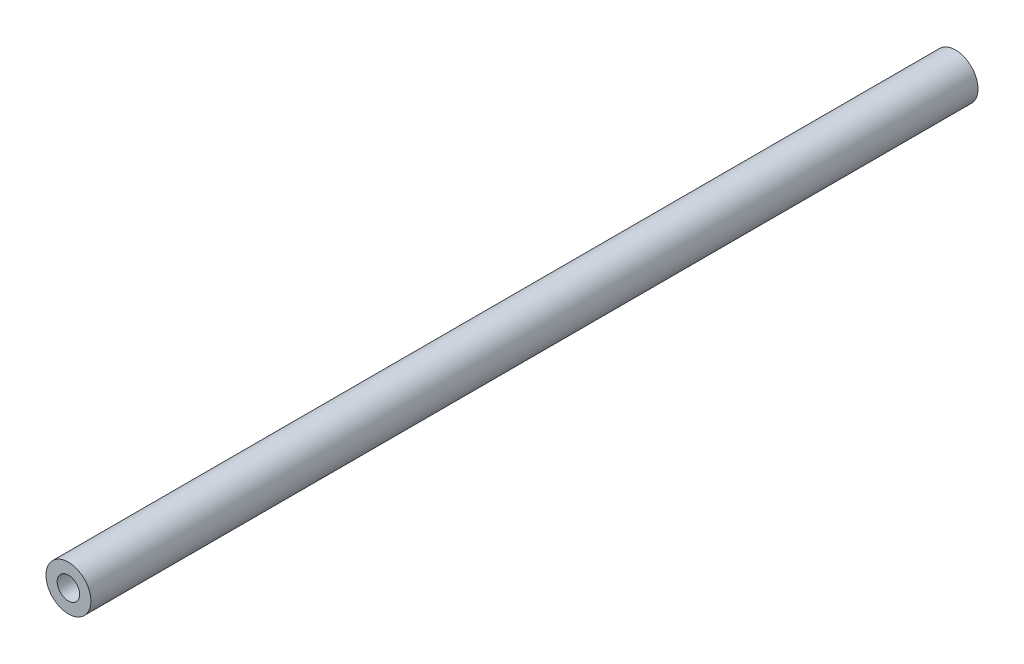
ISO-10303-21;
HEADER;
FILE_DESCRIPTION(('STEP AP214'),'2;1');
FILE_NAME('part.step','',(''),(''),'','','');
FILE_SCHEMA(('AUTOMOTIVE_DESIGN { 1 0 10303 214 1 1 1 1 }'));
ENDSEC;
DATA;
#1=APPLICATION_CONTEXT('core data for automotive mechanical design processes');
#2=APPLICATION_PROTOCOL_DEFINITION('international standard','automotive_design',2000,#1);
#3=PRODUCT_CONTEXT('',#1,'mechanical');
#4=PRODUCT('Part','Part','',(#3));
#5=PRODUCT_RELATED_PRODUCT_CATEGORY('part','',(#4));
#6=PRODUCT_DEFINITION_FORMATION('','',#4);
#7=PRODUCT_DEFINITION_CONTEXT('part definition',#1,'design');
#8=PRODUCT_DEFINITION('design','',#6,#7);
#9=PRODUCT_DEFINITION_SHAPE('','',#8);
#10=(LENGTH_UNIT() NAMED_UNIT(*) SI_UNIT(.MILLI.,.METRE.));
#11=(NAMED_UNIT(*) PLANE_ANGLE_UNIT() SI_UNIT($,.RADIAN.));
#12=(NAMED_UNIT(*) SI_UNIT($,.STERADIAN.) SOLID_ANGLE_UNIT());
#13=UNCERTAINTY_MEASURE_WITH_UNIT(LENGTH_MEASURE(1.E-05),#10,'distance_accuracy_value','');
#14=(GEOMETRIC_REPRESENTATION_CONTEXT(3) GLOBAL_UNCERTAINTY_ASSIGNED_CONTEXT((#13)) GLOBAL_UNIT_ASSIGNED_CONTEXT((#10,
#11,#12)) REPRESENTATION_CONTEXT('',''));
#15=CARTESIAN_POINT('',(0.,0.,0.));
#16=DIRECTION('',(0.,0.,1.));
#17=DIRECTION('',(1.,0.,0.));
#18=AXIS2_PLACEMENT_3D('',#15,#16,#17);
#19=CARTESIAN_POINT('',(0.,0.,79.));
#20=DIRECTION('',(0.,0.,1.));
#21=DIRECTION('',(1.,0.,0.));
#22=AXIS2_PLACEMENT_3D('',#19,#20,#21);
#23=PLANE('',#22);
#24=CARTESIAN_POINT('',(0.,0.,79.));
#25=DIRECTION('',(0.,0.,1.));
#26=DIRECTION('',(1.,0.,0.));
#27=AXIS2_PLACEMENT_3D('',#24,#25,#26);
#28=CIRCLE('',#27,2.);
#29=CARTESIAN_POINT('',(2.,0.,79.));
#30=VERTEX_POINT('',#29);
#31=EDGE_CURVE('E10',#30,#30,#28,.T.);
#32=ORIENTED_EDGE('',*,*,#31,.T.);
#33=EDGE_LOOP('',(#32));
#34=FACE_BOUND('',#33,.T.);
#35=CARTESIAN_POINT('',(0.,0.,79.));
#36=DIRECTION('',(0.,0.,1.));
#37=DIRECTION('',(1.,0.,0.));
#38=AXIS2_PLACEMENT_3D('',#35,#36,#37);
#39=CIRCLE('',#38,1.);
#40=CARTESIAN_POINT('',(1.,0.,79.));
#41=VERTEX_POINT('',#40);
#42=EDGE_CURVE('E42',#41,#41,#39,.T.);
#43=ORIENTED_EDGE('',*,*,#42,.F.);
#44=EDGE_LOOP('',(#43));
#45=FACE_BOUND('',#44,.T.);
#46=ADVANCED_FACE('F31',(#34,#45),#23,.T.);
#47=CARTESIAN_POINT('',(0.,0.,0.));
#48=DIRECTION('',(0.,0.,1.));
#49=DIRECTION('',(1.,0.,0.));
#50=AXIS2_PLACEMENT_3D('',#47,#48,#49);
#51=PLANE('',#50);
#52=CARTESIAN_POINT('',(0.,0.,0.));
#53=DIRECTION('',(0.,0.,1.));
#54=DIRECTION('',(1.,0.,0.));
#55=AXIS2_PLACEMENT_3D('',#52,#53,#54);
#56=CIRCLE('',#55,2.);
#57=CARTESIAN_POINT('',(2.,0.,0.));
#58=VERTEX_POINT('',#57);
#59=EDGE_CURVE('E35',#58,#58,#56,.T.);
#60=ORIENTED_EDGE('',*,*,#59,.F.);
#61=EDGE_LOOP('',(#60));
#62=FACE_BOUND('',#61,.T.);
#63=CARTESIAN_POINT('',(0.,0.,0.));
#64=DIRECTION('',(0.,0.,1.));
#65=DIRECTION('',(1.,0.,0.));
#66=AXIS2_PLACEMENT_3D('',#63,#64,#65);
#67=CIRCLE('',#66,1.);
#68=CARTESIAN_POINT('',(1.,0.,0.));
#69=VERTEX_POINT('',#68);
#70=EDGE_CURVE('E44',#69,#69,#67,.T.);
#71=ORIENTED_EDGE('',*,*,#70,.T.);
#72=EDGE_LOOP('',(#71));
#73=FACE_BOUND('',#72,.T.);
#74=ADVANCED_FACE('F54',(#62,#73),#51,.F.);
#75=CARTESIAN_POINT('',(0.,0.,79.));
#76=DIRECTION('',(0.,0.,-1.));
#77=DIRECTION('',(-1.,0.,0.));
#78=AXIS2_PLACEMENT_3D('',#75,#76,#77);
#79=CYLINDRICAL_SURFACE('',#78,2.);
#80=ORIENTED_EDGE('',*,*,#31,.F.);
#81=EDGE_LOOP('',(#80));
#82=FACE_BOUND('',#81,.T.);
#83=ORIENTED_EDGE('',*,*,#59,.T.);
#84=EDGE_LOOP('',(#83));
#85=FACE_BOUND('',#84,.T.);
#86=ADVANCED_FACE('F33',(#82,#85),#79,.T.);
#87=CARTESIAN_POINT('',(0.,0.,79.));
#88=DIRECTION('',(0.,0.,-1.));
#89=DIRECTION('',(-1.,0.,0.));
#90=AXIS2_PLACEMENT_3D('',#87,#88,#89);
#91=CYLINDRICAL_SURFACE('',#90,1.);
#92=ORIENTED_EDGE('',*,*,#42,.T.);
#93=EDGE_LOOP('',(#92));
#94=FACE_BOUND('',#93,.T.);
#95=ORIENTED_EDGE('',*,*,#70,.F.);
#96=EDGE_LOOP('',(#95));
#97=FACE_BOUND('',#96,.T.);
#98=ADVANCED_FACE('F50',(#94,#97),#91,.F.);
#99=CLOSED_SHELL('',(#46,#74,#86,#98));
#100=MANIFOLD_SOLID_BREP('B2',#99);
#101=ADVANCED_BREP_SHAPE_REPRESENTATION('',(#18,#100),#14);
#102=SHAPE_DEFINITION_REPRESENTATION(#9,#101);
ENDSEC;
END-ISO-10303-21;
